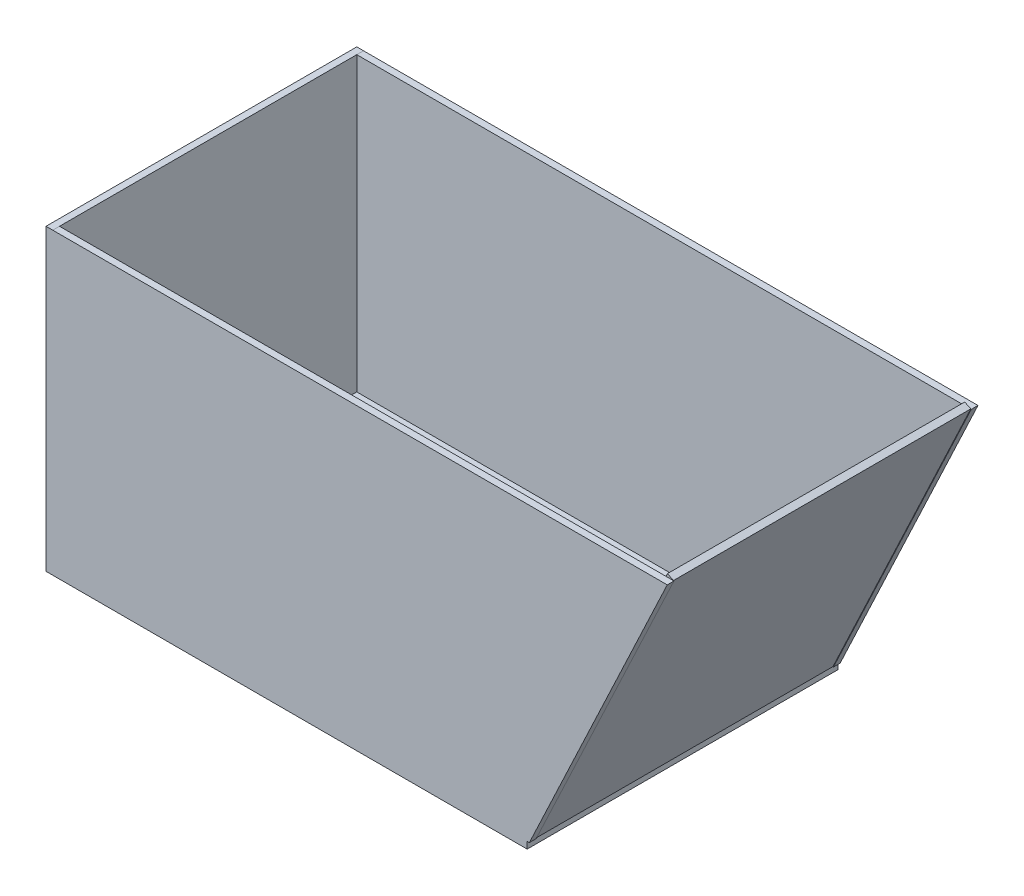
ISO-10303-21;
HEADER;
FILE_DESCRIPTION(('STEP AP214'),'2;1');
FILE_NAME('part.step','',(''),(''),'','','');
FILE_SCHEMA(('AUTOMOTIVE_DESIGN { 1 0 10303 214 1 1 1 1 }'));
ENDSEC;
DATA;
#1=APPLICATION_CONTEXT('core data for automotive mechanical design processes');
#2=APPLICATION_PROTOCOL_DEFINITION('international standard','automotive_design',2000,#1);
#3=PRODUCT_CONTEXT('',#1,'mechanical');
#4=PRODUCT('Part','Part','',(#3));
#5=PRODUCT_RELATED_PRODUCT_CATEGORY('part','',(#4));
#6=PRODUCT_DEFINITION_FORMATION('','',#4);
#7=PRODUCT_DEFINITION_CONTEXT('part definition',#1,'design');
#8=PRODUCT_DEFINITION('design','',#6,#7);
#9=PRODUCT_DEFINITION_SHAPE('','',#8);
#10=(LENGTH_UNIT() NAMED_UNIT(*) SI_UNIT(.MILLI.,.METRE.));
#11=(NAMED_UNIT(*) PLANE_ANGLE_UNIT() SI_UNIT($,.RADIAN.));
#12=(NAMED_UNIT(*) SI_UNIT($,.STERADIAN.) SOLID_ANGLE_UNIT());
#13=UNCERTAINTY_MEASURE_WITH_UNIT(LENGTH_MEASURE(1.E-05),#10,'distance_accuracy_value','');
#14=(GEOMETRIC_REPRESENTATION_CONTEXT(3) GLOBAL_UNCERTAINTY_ASSIGNED_CONTEXT((#13)) GLOBAL_UNIT_ASSIGNED_CONTEXT((#10,
#11,#12)) REPRESENTATION_CONTEXT('',''));
#15=CARTESIAN_POINT('',(0.,0.,0.));
#16=DIRECTION('',(0.,0.,1.));
#17=DIRECTION('',(1.,0.,0.));
#18=AXIS2_PLACEMENT_3D('',#15,#16,#17);
#19=CARTESIAN_POINT('',(352.233939342679,284.329831115546,139.934782687036));
#20=DIRECTION('',(0.,0.,1.));
#21=DIRECTION('',(1.,0.,0.));
#22=AXIS2_PLACEMENT_3D('',#19,#20,#21);
#23=PLANE('',#22);
#24=DIRECTION('',(-0.426808919266063,-0.904341830523689,0.));
#25=VECTOR('',#24,1.);
#26=CARTESIAN_POINT('',(357.976509966504,281.619594478207,139.934782687036));
#27=LINE('',#26,#25);
#28=CARTESIAN_POINT('',(357.976509966504,281.619594478207,139.934782687036));
#29=VERTEX_POINT('',#28);
#30=CARTESIAN_POINT('',(228.154221077472,6.54632145811838,139.934782687036));
#31=VERTEX_POINT('',#30);
#32=EDGE_CURVE('E112',#29,#31,#27,.T.);
#33=ORIENTED_EDGE('',*,*,#32,.F.);
#34=DIRECTION('',(0.904341830523688,-0.426808919266063,0.));
#35=VECTOR('',#34,1.);
#36=CARTESIAN_POINT('',(352.233939342679,284.329831115546,139.934782687036));
#37=LINE('',#36,#35);
#38=CARTESIAN_POINT('',(352.233939342679,284.329831115546,139.934782687036));
#39=VERTEX_POINT('',#38);
#40=EDGE_CURVE('E12',#39,#29,#37,.T.);
#41=ORIENTED_EDGE('',*,*,#40,.F.);
#42=DIRECTION('',(-0.426808919266063,-0.904341830523689,0.));
#43=VECTOR('',#42,1.);
#44=CARTESIAN_POINT('',(352.233939342679,284.329831115546,139.934782687036));
#45=LINE('',#44,#43);
#46=CARTESIAN_POINT('',(222.411650453647,9.25655809545788,139.934782687036));
#47=VERTEX_POINT('',#46);
#48=EDGE_CURVE('E106',#39,#47,#45,.T.);
#49=ORIENTED_EDGE('',*,*,#48,.T.);
#50=DIRECTION('',(0.904341830523688,-0.426808919266063,0.));
#51=VECTOR('',#50,1.);
#52=CARTESIAN_POINT('',(222.411650453647,9.25655809545788,139.934782687036));
#53=LINE('',#52,#51);
#54=EDGE_CURVE('E51',#47,#31,#53,.T.);
#55=ORIENTED_EDGE('',*,*,#54,.T.);
#56=EDGE_LOOP('',(#33,#41,#49,#55));
#57=FACE_BOUND('',#56,.T.);
#58=ADVANCED_FACE('F48',(#57),#23,.T.);
#59=CARTESIAN_POINT('',(352.233939342679,284.329831115546,139.934782687036));
#60=DIRECTION('',(0.426808919266063,0.904341830523688,0.));
#61=DIRECTION('',(-0.904341830523689,0.426808919266063,0.));
#62=AXIS2_PLACEMENT_3D('',#59,#60,#61);
#63=PLANE('',#62);
#64=DIRECTION('',(0.,0.,1.));
#65=VECTOR('',#64,1.);
#66=CARTESIAN_POINT('',(357.976509966504,281.619594478207,139.934782687036));
#67=LINE('',#66,#65);
#68=CARTESIAN_POINT('',(357.976509966504,281.619594478207,-139.934782687036));
#69=VERTEX_POINT('',#68);
#70=EDGE_CURVE('E108',#69,#29,#67,.T.);
#71=ORIENTED_EDGE('',*,*,#70,.F.);
#72=DIRECTION('',(0.904341830523688,-0.426808919266063,0.));
#73=VECTOR('',#72,1.);
#74=CARTESIAN_POINT('',(352.233939342679,284.329831115546,-139.934782687036));
#75=LINE('',#74,#73);
#76=CARTESIAN_POINT('',(352.233939342679,284.329831115546,-139.934782687036));
#77=VERTEX_POINT('',#76);
#78=EDGE_CURVE('E57',#77,#69,#75,.T.);
#79=ORIENTED_EDGE('',*,*,#78,.F.);
#80=DIRECTION('',(0.,0.,1.));
#81=VECTOR('',#80,1.);
#82=CARTESIAN_POINT('',(352.233939342679,284.329831115546,139.934782687036));
#83=LINE('',#82,#81);
#84=EDGE_CURVE('E103',#77,#39,#83,.T.);
#85=ORIENTED_EDGE('',*,*,#84,.T.);
#86=ORIENTED_EDGE('',*,*,#40,.T.);
#87=EDGE_LOOP('',(#71,#79,#85,#86));
#88=FACE_BOUND('',#87,.T.);
#89=ADVANCED_FACE('F122',(#88),#63,.T.);
#90=CARTESIAN_POINT('',(352.233939342679,284.329831115546,-139.934782687036));
#91=DIRECTION('',(0.,0.,-1.));
#92=DIRECTION('',(-1.,0.,0.));
#93=AXIS2_PLACEMENT_3D('',#90,#91,#92);
#94=PLANE('',#93);
#95=DIRECTION('',(0.426808919266063,0.904341830523689,0.));
#96=VECTOR('',#95,1.);
#97=CARTESIAN_POINT('',(357.976509966504,281.619594478207,-139.934782687036));
#98=LINE('',#97,#96);
#99=CARTESIAN_POINT('',(228.154221077472,6.54632145811838,-139.934782687036));
#100=VERTEX_POINT('',#99);
#101=EDGE_CURVE('E98',#100,#69,#98,.T.);
#102=ORIENTED_EDGE('',*,*,#101,.F.);
#103=DIRECTION('',(0.904341830523688,-0.426808919266063,0.));
#104=VECTOR('',#103,1.);
#105=CARTESIAN_POINT('',(222.411650453647,9.25655809545788,-139.934782687036));
#106=LINE('',#105,#104);
#107=CARTESIAN_POINT('',(222.411650453647,9.25655809545788,-139.934782687036));
#108=VERTEX_POINT('',#107);
#109=EDGE_CURVE('E93',#108,#100,#106,.T.);
#110=ORIENTED_EDGE('',*,*,#109,.F.);
#111=DIRECTION('',(0.426808919266063,0.904341830523689,0.));
#112=VECTOR('',#111,1.);
#113=CARTESIAN_POINT('',(352.233939342679,284.329831115546,-139.934782687036));
#114=LINE('',#113,#112);
#115=EDGE_CURVE('E96',#108,#77,#114,.T.);
#116=ORIENTED_EDGE('',*,*,#115,.T.);
#117=ORIENTED_EDGE('',*,*,#78,.T.);
#118=EDGE_LOOP('',(#102,#110,#116,#117));
#119=FACE_BOUND('',#118,.T.);
#120=ADVANCED_FACE('F95',(#119),#94,.T.);
#121=CARTESIAN_POINT('',(222.411650453647,9.25655809545788,139.934782687036));
#122=DIRECTION('',(-0.426808919266063,-0.904341830523688,0.));
#123=DIRECTION('',(0.904341830523689,-0.426808919266063,0.));
#124=AXIS2_PLACEMENT_3D('',#121,#122,#123);
#125=PLANE('',#124);
#126=DIRECTION('',(0.,0.,-1.));
#127=VECTOR('',#126,1.);
#128=CARTESIAN_POINT('',(228.154221077472,6.54632145811838,139.934782687036));
#129=LINE('',#128,#127);
#130=EDGE_CURVE('E115',#31,#100,#129,.T.);
#131=ORIENTED_EDGE('',*,*,#130,.F.);
#132=ORIENTED_EDGE('',*,*,#54,.F.);
#133=DIRECTION('',(0.,0.,-1.));
#134=VECTOR('',#133,1.);
#135=CARTESIAN_POINT('',(222.411650453647,9.25655809545788,139.934782687036));
#136=LINE('',#135,#134);
#137=EDGE_CURVE('E102',#47,#108,#136,.T.);
#138=ORIENTED_EDGE('',*,*,#137,.T.);
#139=ORIENTED_EDGE('',*,*,#109,.T.);
#140=EDGE_LOOP('',(#131,#132,#138,#139));
#141=FACE_BOUND('',#140,.T.);
#142=ADVANCED_FACE('F105',(#141),#125,.T.);
#143=CARTESIAN_POINT('',(178.322985280826,-84.1604778847105,0.));
#144=DIRECTION('',(0.904341830523689,-0.426808919266063,0.));
#145=DIRECTION('',(0.426808919266063,0.904341830523689,0.));
#146=AXIS2_PLACEMENT_3D('',#143,#144,#145);
#147=PLANE('',#146);
#148=ORIENTED_EDGE('',*,*,#48,.F.);
#149=ORIENTED_EDGE('',*,*,#84,.F.);
#150=ORIENTED_EDGE('',*,*,#115,.F.);
#151=ORIENTED_EDGE('',*,*,#137,.F.);
#152=EDGE_LOOP('',(#148,#149,#150,#151));
#153=FACE_BOUND('',#152,.T.);
#154=ADVANCED_FACE('F101',(#153),#147,.F.);
#155=CARTESIAN_POINT('',(184.065555904652,-86.87071452205,0.));
#156=DIRECTION('',(0.904341830523689,-0.426808919266063,0.));
#157=DIRECTION('',(0.426808919266063,0.904341830523689,0.));
#158=AXIS2_PLACEMENT_3D('',#155,#156,#157);
#159=PLANE('',#158);
#160=ORIENTED_EDGE('',*,*,#32,.T.);
#161=ORIENTED_EDGE('',*,*,#130,.T.);
#162=ORIENTED_EDGE('',*,*,#101,.T.);
#163=ORIENTED_EDGE('',*,*,#70,.T.);
#164=EDGE_LOOP('',(#160,#161,#162,#163));
#165=FACE_BOUND('',#164,.T.);
#166=ADVANCED_FACE('F121',(#165),#159,.T.);
#167=CLOSED_SHELL('',(#58,#89,#120,#142,#154,#166));
#168=MANIFOLD_SOLID_BREP('B2',#167);
#169=CARTESIAN_POINT('',(0.,6.35,0.));
#170=DIRECTION('',(0.,-1.,0.));
#171=DIRECTION('',(0.,0.,-1.));
#172=AXIS2_PLACEMENT_3D('',#169,#170,#171);
#173=PLANE('',#172);
#174=DIRECTION('',(1.,0.,0.));
#175=VECTOR('',#174,1.);
#176=CARTESIAN_POINT('',(228.570195764953,6.35000000000006,-139.934782687036));
#177=LINE('',#176,#175);
#178=CARTESIAN_POINT('',(-220.15,6.35,-139.934782687036));
#179=VERTEX_POINT('',#178);
#180=CARTESIAN_POINT('',(226.5,6.35000000000006,-139.934782687036));
#181=VERTEX_POINT('',#180);
#182=EDGE_CURVE('E303',#179,#181,#177,.T.);
#183=ORIENTED_EDGE('',*,*,#182,.F.);
#184=DIRECTION('',(0.,0.,-1.));
#185=VECTOR('',#184,1.);
#186=CARTESIAN_POINT('',(-220.15,6.35,-146.284782687036));
#187=LINE('',#186,#185);
#188=CARTESIAN_POINT('',(-220.15,6.35,139.934782687036));
#189=VERTEX_POINT('',#188);
#190=EDGE_CURVE('E335',#189,#179,#187,.T.);
#191=ORIENTED_EDGE('',*,*,#190,.F.);
#192=DIRECTION('',(1.,0.,0.));
#193=VECTOR('',#192,1.);
#194=CARTESIAN_POINT('',(228.570195764953,6.35000000000006,139.934782687036));
#195=LINE('',#194,#193);
#196=CARTESIAN_POINT('',(226.5,6.35000000000006,139.934782687036));
#197=VERTEX_POINT('',#196);
#198=EDGE_CURVE('E320',#189,#197,#195,.T.);
#199=ORIENTED_EDGE('',*,*,#198,.T.);
#200=DIRECTION('',(0.,0.,-1.));
#201=VECTOR('',#200,1.);
#202=CARTESIAN_POINT('',(226.5,6.35,146.284782687036));
#203=LINE('',#202,#201);
#204=EDGE_CURVE('E357',#197,#181,#203,.T.);
#205=ORIENTED_EDGE('',*,*,#204,.T.);
#206=EDGE_LOOP('',(#183,#191,#199,#205));
#207=FACE_BOUND('',#206,.T.);
#208=ADVANCED_FACE('F183',(#207),#173,.F.);
#209=CARTESIAN_POINT('',(-220.15,281.35,-146.284782687036));
#210=DIRECTION('',(-1.,0.,0.));
#211=DIRECTION('',(0.,0.,1.));
#212=AXIS2_PLACEMENT_3D('',#209,#210,#211);
#213=PLANE('',#212);
#214=DIRECTION('',(0.,-1.,0.));
#215=VECTOR('',#214,1.);
#216=CARTESIAN_POINT('',(-220.15,6.35,-139.934782687036));
#217=LINE('',#216,#215);
#218=CARTESIAN_POINT('',(-220.15,281.35,-139.934782687036));
#219=VERTEX_POINT('',#218);
#220=EDGE_CURVE('E293',#219,#179,#217,.T.);
#221=ORIENTED_EDGE('',*,*,#220,.F.);
#222=DIRECTION('',(0.,0.,-1.));
#223=VECTOR('',#222,1.);
#224=CARTESIAN_POINT('',(-220.15,281.35,-146.284782687036));
#225=LINE('',#224,#223);
#226=CARTESIAN_POINT('',(-220.15,281.35,139.934782687036));
#227=VERTEX_POINT('',#226);
#228=EDGE_CURVE('E344',#227,#219,#225,.T.);
#229=ORIENTED_EDGE('',*,*,#228,.F.);
#230=DIRECTION('',(0.,-1.,0.));
#231=VECTOR('',#230,1.);
#232=CARTESIAN_POINT('',(-220.15,6.35,139.934782687036));
#233=LINE('',#232,#231);
#234=EDGE_CURVE('E315',#227,#189,#233,.T.);
#235=ORIENTED_EDGE('',*,*,#234,.T.);
#236=ORIENTED_EDGE('',*,*,#190,.T.);
#237=EDGE_LOOP('',(#221,#229,#235,#236));
#238=FACE_BOUND('',#237,.T.);
#239=ADVANCED_FACE('F409',(#238),#213,.F.);
#240=CARTESIAN_POINT('',(226.5,6.35,146.284782687036));
#241=DIRECTION('',(-1.,0.,0.));
#242=DIRECTION('',(0.,0.,1.));
#243=AXIS2_PLACEMENT_3D('',#240,#241,#242);
#244=PLANE('',#243);
#245=DIRECTION('',(0.,0.,-1.));
#246=VECTOR('',#245,1.);
#247=CARTESIAN_POINT('',(226.5,0.,146.284782687036));
#248=LINE('',#247,#246);
#249=CARTESIAN_POINT('',(226.5,0.,146.284782687036));
#250=VERTEX_POINT('',#249);
#251=CARTESIAN_POINT('',(226.5,0.,-146.284782687036));
#252=VERTEX_POINT('',#251);
#253=EDGE_CURVE('E351',#250,#252,#248,.T.);
#254=ORIENTED_EDGE('',*,*,#253,.T.);
#255=DIRECTION('',(0.,-1.,0.));
#256=VECTOR('',#255,1.);
#257=CARTESIAN_POINT('',(226.5,6.35,-146.284782687036));
#258=LINE('',#257,#256);
#259=CARTESIAN_POINT('',(226.5,6.35000000000006,-146.284782687036));
#260=VERTEX_POINT('',#259);
#261=EDGE_CURVE('E46',#260,#252,#258,.T.);
#262=ORIENTED_EDGE('',*,*,#261,.F.);
#263=DIRECTION('',(0.,0.,-1.));
#264=VECTOR('',#263,1.);
#265=CARTESIAN_POINT('',(226.5,6.35000000000006,146.284782687036));
#266=LINE('',#265,#264);
#267=EDGE_CURVE('E310',#181,#260,#266,.T.);
#268=ORIENTED_EDGE('',*,*,#267,.F.);
#269=ORIENTED_EDGE('',*,*,#204,.F.);
#270=CARTESIAN_POINT('',(226.5,6.35000000000006,146.284782687036));
#271=VERTEX_POINT('',#270);
#272=EDGE_CURVE('E354',#271,#197,#203,.T.);
#273=ORIENTED_EDGE('',*,*,#272,.F.);
#274=DIRECTION('',(0.,-1.,0.));
#275=VECTOR('',#274,1.);
#276=CARTESIAN_POINT('',(226.5,6.35,146.284782687036));
#277=LINE('',#276,#275);
#278=EDGE_CURVE('E356',#271,#250,#277,.T.);
#279=ORIENTED_EDGE('',*,*,#278,.T.);
#280=EDGE_LOOP('',(#254,#262,#268,#269,#273,#279));
#281=FACE_BOUND('',#280,.T.);
#282=ADVANCED_FACE('F185',(#281),#244,.F.);
#283=CARTESIAN_POINT('',(-226.5,6.35,-146.284782687036));
#284=DIRECTION('',(0.,0.,1.));
#285=DIRECTION('',(1.,0.,0.));
#286=AXIS2_PLACEMENT_3D('',#283,#284,#285);
#287=PLANE('',#286);
#288=DIRECTION('',(-1.,0.,0.));
#289=VECTOR('',#288,1.);
#290=CARTESIAN_POINT('',(-226.5,0.,-146.284782687036));
#291=LINE('',#290,#289);
#292=CARTESIAN_POINT('',(-226.5,0.,-146.284782687036));
#293=VERTEX_POINT('',#292);
#294=EDGE_CURVE('E360',#252,#293,#291,.T.);
#295=ORIENTED_EDGE('',*,*,#294,.T.);
#296=DIRECTION('',(0.,-1.,0.));
#297=VECTOR('',#296,1.);
#298=CARTESIAN_POINT('',(-226.5,6.35,-146.284782687036));
#299=LINE('',#298,#297);
#300=CARTESIAN_POINT('',(-226.5,281.35,-146.284782687036));
#301=VERTEX_POINT('',#300);
#302=EDGE_CURVE('E191',#301,#293,#299,.T.);
#303=ORIENTED_EDGE('',*,*,#302,.F.);
#304=DIRECTION('',(-1.,0.,0.));
#305=VECTOR('',#304,1.);
#306=CARTESIAN_POINT('',(-226.5,281.35,-146.284782687036));
#307=LINE('',#306,#305);
#308=CARTESIAN_POINT('',(-220.15,281.35,-146.284782687036));
#309=VERTEX_POINT('',#308);
#310=EDGE_CURVE('E348',#309,#301,#307,.T.);
#311=ORIENTED_EDGE('',*,*,#310,.F.);
#312=DIRECTION('',(-0.999999991979754,-0.000126651060974976,0.));
#313=VECTOR('',#312,1.);
#314=CARTESIAN_POINT('',(-220.15,281.35,-146.284782687036));
#315=LINE('',#314,#313);
#316=CARTESIAN_POINT('',(358.392484653985,281.423273020088,-146.284782687036));
#317=VERTEX_POINT('',#316);
#318=EDGE_CURVE('E306',#317,#309,#315,.T.);
#319=ORIENTED_EDGE('',*,*,#318,.F.);
#320=DIRECTION('',(0.426808919266063,0.904341830523689,0.));
#321=VECTOR('',#320,1.);
#322=CARTESIAN_POINT('',(358.392484653985,281.423273020088,-146.284782687036));
#323=LINE('',#322,#321);
#324=CARTESIAN_POINT('',(228.570195764953,6.35000000000006,-146.284782687036));
#325=VERTEX_POINT('',#324);
#326=EDGE_CURVE('E289',#325,#317,#323,.T.);
#327=ORIENTED_EDGE('',*,*,#326,.F.);
#328=DIRECTION('',(1.,0.,0.));
#329=VECTOR('',#328,1.);
#330=CARTESIAN_POINT('',(228.570195764953,6.35000000000006,-146.284782687036));
#331=LINE('',#330,#329);
#332=EDGE_CURVE('E299',#260,#325,#331,.T.);
#333=ORIENTED_EDGE('',*,*,#332,.F.);
#334=ORIENTED_EDGE('',*,*,#261,.T.);
#335=EDGE_LOOP('',(#295,#303,#311,#319,#327,#333,#334));
#336=FACE_BOUND('',#335,.T.);
#337=ADVANCED_FACE('F397',(#336),#287,.F.);
#338=CARTESIAN_POINT('',(-226.5,6.35,146.284782687036));
#339=DIRECTION('',(1.,0.,0.));
#340=DIRECTION('',(0.,0.,-1.));
#341=AXIS2_PLACEMENT_3D('',#338,#339,#340);
#342=PLANE('',#341);
#343=DIRECTION('',(0.,0.,1.));
#344=VECTOR('',#343,1.);
#345=CARTESIAN_POINT('',(-226.5,0.,146.284782687036));
#346=LINE('',#345,#344);
#347=CARTESIAN_POINT('',(-226.5,0.,146.284782687036));
#348=VERTEX_POINT('',#347);
#349=EDGE_CURVE('E362',#293,#348,#346,.T.);
#350=ORIENTED_EDGE('',*,*,#349,.T.);
#351=DIRECTION('',(0.,-1.,0.));
#352=VECTOR('',#351,1.);
#353=CARTESIAN_POINT('',(-226.5,6.35,146.284782687036));
#354=LINE('',#353,#352);
#355=CARTESIAN_POINT('',(-226.5,281.35,146.284782687036));
#356=VERTEX_POINT('',#355);
#357=EDGE_CURVE('E366',#356,#348,#354,.T.);
#358=ORIENTED_EDGE('',*,*,#357,.F.);
#359=DIRECTION('',(0.,0.,1.));
#360=VECTOR('',#359,1.);
#361=CARTESIAN_POINT('',(-226.5,281.35,-146.284782687036));
#362=LINE('',#361,#360);
#363=EDGE_CURVE('E338',#301,#356,#362,.T.);
#364=ORIENTED_EDGE('',*,*,#363,.F.);
#365=ORIENTED_EDGE('',*,*,#302,.T.);
#366=EDGE_LOOP('',(#350,#358,#364,#365));
#367=FACE_BOUND('',#366,.T.);
#368=ADVANCED_FACE('F371',(#367),#342,.F.);
#369=CARTESIAN_POINT('',(-226.5,6.35,146.284782687036));
#370=DIRECTION('',(0.,0.,-1.));
#371=DIRECTION('',(-1.,0.,0.));
#372=AXIS2_PLACEMENT_3D('',#369,#370,#371);
#373=PLANE('',#372);
#374=ORIENTED_EDGE('',*,*,#278,.F.);
#375=DIRECTION('',(1.,0.,0.));
#376=VECTOR('',#375,1.);
#377=CARTESIAN_POINT('',(228.570195764953,6.35000000000006,146.284782687036));
#378=LINE('',#377,#376);
#379=CARTESIAN_POINT('',(228.570195764953,6.35000000000006,146.284782687036));
#380=VERTEX_POINT('',#379);
#381=EDGE_CURVE('E329',#271,#380,#378,.T.);
#382=ORIENTED_EDGE('',*,*,#381,.T.);
#383=DIRECTION('',(0.426808919266063,0.904341830523689,0.));
#384=VECTOR('',#383,1.);
#385=CARTESIAN_POINT('',(358.392484653985,281.423273020088,146.284782687036));
#386=LINE('',#385,#384);
#387=CARTESIAN_POINT('',(358.392484653985,281.423273020088,146.284782687036));
#388=VERTEX_POINT('',#387);
#389=EDGE_CURVE('E316',#380,#388,#386,.T.);
#390=ORIENTED_EDGE('',*,*,#389,.T.);
#391=DIRECTION('',(-0.999999991979754,-0.000126651060974976,0.));
#392=VECTOR('',#391,1.);
#393=CARTESIAN_POINT('',(-220.15,281.35,146.284782687036));
#394=LINE('',#393,#392);
#395=CARTESIAN_POINT('',(-220.15,281.35,146.284782687036));
#396=VERTEX_POINT('',#395);
#397=EDGE_CURVE('E313',#388,#396,#394,.T.);
#398=ORIENTED_EDGE('',*,*,#397,.T.);
#399=DIRECTION('',(1.,0.,0.));
#400=VECTOR('',#399,1.);
#401=CARTESIAN_POINT('',(-226.5,281.35,146.284782687036));
#402=LINE('',#401,#400);
#403=EDGE_CURVE('E341',#356,#396,#402,.T.);
#404=ORIENTED_EDGE('',*,*,#403,.F.);
#405=ORIENTED_EDGE('',*,*,#357,.T.);
#406=DIRECTION('',(1.,0.,0.));
#407=VECTOR('',#406,1.);
#408=CARTESIAN_POINT('',(-226.5,0.,146.284782687036));
#409=LINE('',#408,#407);
#410=EDGE_CURVE('E206',#348,#250,#409,.T.);
#411=ORIENTED_EDGE('',*,*,#410,.T.);
#412=EDGE_LOOP('',(#374,#382,#390,#398,#404,#405,#411));
#413=FACE_BOUND('',#412,.T.);
#414=ADVANCED_FACE('F382',(#413),#373,.F.);
#415=CARTESIAN_POINT('',(0.,0.,0.));
#416=DIRECTION('',(0.,-1.,0.));
#417=DIRECTION('',(0.,0.,-1.));
#418=AXIS2_PLACEMENT_3D('',#415,#416,#417);
#419=PLANE('',#418);
#420=ORIENTED_EDGE('',*,*,#253,.F.);
#421=ORIENTED_EDGE('',*,*,#410,.F.);
#422=ORIENTED_EDGE('',*,*,#349,.F.);
#423=ORIENTED_EDGE('',*,*,#294,.F.);
#424=EDGE_LOOP('',(#420,#421,#422,#423));
#425=FACE_BOUND('',#424,.T.);
#426=ADVANCED_FACE('F376',(#425),#419,.T.);
#427=CARTESIAN_POINT('',(0.,281.35,0.));
#428=DIRECTION('',(0.,1.,0.));
#429=DIRECTION('',(0.,0.,1.));
#430=AXIS2_PLACEMENT_3D('',#427,#428,#429);
#431=PLANE('',#430);
#432=ORIENTED_EDGE('',*,*,#363,.T.);
#433=ORIENTED_EDGE('',*,*,#403,.T.);
#434=EDGE_CURVE('E345',#396,#227,#225,.T.);
#435=ORIENTED_EDGE('',*,*,#434,.T.);
#436=ORIENTED_EDGE('',*,*,#228,.T.);
#437=DIRECTION('',(0.,0.,-1.));
#438=VECTOR('',#437,1.);
#439=CARTESIAN_POINT('',(-220.15,281.35,-139.934782687036));
#440=LINE('',#439,#438);
#441=EDGE_CURVE('E297',#219,#309,#440,.T.);
#442=ORIENTED_EDGE('',*,*,#441,.T.);
#443=ORIENTED_EDGE('',*,*,#310,.T.);
#444=EDGE_LOOP('',(#432,#433,#435,#436,#442,#443));
#445=FACE_BOUND('',#444,.T.);
#446=ADVANCED_FACE('F395',(#445),#431,.T.);
#447=CARTESIAN_POINT('',(228.570195764953,6.35000000000006,139.934782687036));
#448=DIRECTION('',(0.,-1.,0.));
#449=DIRECTION('',(1.,0.,0.));
#450=AXIS2_PLACEMENT_3D('',#447,#448,#449);
#451=PLANE('',#450);
#452=ORIENTED_EDGE('',*,*,#272,.T.);
#453=CARTESIAN_POINT('',(228.570195764953,6.35000000000006,139.934782687036));
#454=VERTEX_POINT('',#453);
#455=EDGE_CURVE('E319',#197,#454,#195,.T.);
#456=ORIENTED_EDGE('',*,*,#455,.T.);
#457=DIRECTION('',(0.,0.,1.));
#458=VECTOR('',#457,1.);
#459=CARTESIAN_POINT('',(228.570195764953,6.35000000000006,139.934782687036));
#460=LINE('',#459,#458);
#461=EDGE_CURVE('E326',#454,#380,#460,.T.);
#462=ORIENTED_EDGE('',*,*,#461,.T.);
#463=ORIENTED_EDGE('',*,*,#381,.F.);
#464=EDGE_LOOP('',(#452,#456,#462,#463));
#465=FACE_BOUND('',#464,.T.);
#466=ADVANCED_FACE('F386',(#465),#451,.T.);
#467=CARTESIAN_POINT('',(-220.15,281.35,139.934782687036));
#468=DIRECTION('',(-0.000126651060974976,0.999999991979754,0.));
#469=DIRECTION('',(-0.999999991979754,-0.000126651060974976,0.));
#470=AXIS2_PLACEMENT_3D('',#467,#468,#469);
#471=PLANE('',#470);
#472=ORIENTED_EDGE('',*,*,#397,.F.);
#473=DIRECTION('',(0.,0.,1.));
#474=VECTOR('',#473,1.);
#475=CARTESIAN_POINT('',(358.392484653985,281.423273020088,139.934782687036));
#476=LINE('',#475,#474);
#477=CARTESIAN_POINT('',(358.392484653985,281.423273020088,139.934782687036));
#478=VERTEX_POINT('',#477);
#479=EDGE_CURVE('E333',#478,#388,#476,.T.);
#480=ORIENTED_EDGE('',*,*,#479,.F.);
#481=DIRECTION('',(-0.999999991979754,-0.000126651060974976,0.));
#482=VECTOR('',#481,1.);
#483=CARTESIAN_POINT('',(-220.15,281.35,139.934782687036));
#484=LINE('',#483,#482);
#485=EDGE_CURVE('E198',#478,#227,#484,.T.);
#486=ORIENTED_EDGE('',*,*,#485,.T.);
#487=ORIENTED_EDGE('',*,*,#434,.F.);
#488=EDGE_LOOP('',(#472,#480,#486,#487));
#489=FACE_BOUND('',#488,.T.);
#490=ADVANCED_FACE('F392',(#489),#471,.T.);
#491=CARTESIAN_POINT('',(358.392484653985,281.423273020088,139.934782687036));
#492=DIRECTION('',(0.904341830523688,-0.426808919266062,0.));
#493=DIRECTION('',(0.426808919266063,0.904341830523689,0.));
#494=AXIS2_PLACEMENT_3D('',#491,#492,#493);
#495=PLANE('',#494);
#496=ORIENTED_EDGE('',*,*,#389,.F.);
#497=ORIENTED_EDGE('',*,*,#461,.F.);
#498=DIRECTION('',(0.426808919266063,0.904341830523689,0.));
#499=VECTOR('',#498,1.);
#500=CARTESIAN_POINT('',(358.392484653985,281.423273020088,139.934782687036));
#501=LINE('',#500,#499);
#502=EDGE_CURVE('E323',#454,#478,#501,.T.);
#503=ORIENTED_EDGE('',*,*,#502,.T.);
#504=ORIENTED_EDGE('',*,*,#479,.T.);
#505=EDGE_LOOP('',(#496,#497,#503,#504));
#506=FACE_BOUND('',#505,.T.);
#507=ADVANCED_FACE('F390',(#506),#495,.T.);
#508=CARTESIAN_POINT('',(0.,0.,139.934782687036));
#509=DIRECTION('',(0.,0.,1.));
#510=DIRECTION('',(1.,0.,0.));
#511=AXIS2_PLACEMENT_3D('',#508,#509,#510);
#512=PLANE('',#511);
#513=ORIENTED_EDGE('',*,*,#485,.F.);
#514=ORIENTED_EDGE('',*,*,#502,.F.);
#515=ORIENTED_EDGE('',*,*,#455,.F.);
#516=ORIENTED_EDGE('',*,*,#198,.F.);
#517=ORIENTED_EDGE('',*,*,#234,.F.);
#518=EDGE_LOOP('',(#513,#514,#515,#516,#517));
#519=FACE_BOUND('',#518,.T.);
#520=ADVANCED_FACE('F406',(#519),#512,.F.);
#521=CARTESIAN_POINT('',(228.570195764953,6.35000000000006,-139.934782687036));
#522=DIRECTION('',(0.,1.,0.));
#523=DIRECTION('',(-1.,0.,0.));
#524=AXIS2_PLACEMENT_3D('',#521,#522,#523);
#525=PLANE('',#524);
#526=CARTESIAN_POINT('',(228.570195764953,6.35000000000006,-139.934782687036));
#527=VERTEX_POINT('',#526);
#528=EDGE_CURVE('E280',#181,#527,#177,.T.);
#529=ORIENTED_EDGE('',*,*,#528,.F.);
#530=ORIENTED_EDGE('',*,*,#267,.T.);
#531=ORIENTED_EDGE('',*,*,#332,.T.);
#532=DIRECTION('',(0.,0.,-1.));
#533=VECTOR('',#532,1.);
#534=CARTESIAN_POINT('',(228.570195764953,6.35000000000006,-139.934782687036));
#535=LINE('',#534,#533);
#536=EDGE_CURVE('E292',#527,#325,#535,.T.);
#537=ORIENTED_EDGE('',*,*,#536,.F.);
#538=EDGE_LOOP('',(#529,#530,#531,#537));
#539=FACE_BOUND('',#538,.T.);
#540=ADVANCED_FACE('F400',(#539),#525,.F.);
#541=CARTESIAN_POINT('',(-220.15,281.35,-139.934782687036));
#542=DIRECTION('',(0.000126651060974976,-0.999999991979754,0.));
#543=DIRECTION('',(0.999999991979754,0.000126651060974976,0.));
#544=AXIS2_PLACEMENT_3D('',#541,#542,#543);
#545=PLANE('',#544);
#546=ORIENTED_EDGE('',*,*,#318,.T.);
#547=ORIENTED_EDGE('',*,*,#441,.F.);
#548=DIRECTION('',(-0.999999991979754,-0.000126651060974976,0.));
#549=VECTOR('',#548,1.);
#550=CARTESIAN_POINT('',(-220.15,281.35,-139.934782687036));
#551=LINE('',#550,#549);
#552=CARTESIAN_POINT('',(358.392484653985,281.423273020088,-139.934782687036));
#553=VERTEX_POINT('',#552);
#554=EDGE_CURVE('E277',#553,#219,#551,.T.);
#555=ORIENTED_EDGE('',*,*,#554,.F.);
#556=DIRECTION('',(0.,0.,-1.));
#557=VECTOR('',#556,1.);
#558=CARTESIAN_POINT('',(358.392484653985,281.423273020088,-139.934782687036));
#559=LINE('',#558,#557);
#560=EDGE_CURVE('E286',#553,#317,#559,.T.);
#561=ORIENTED_EDGE('',*,*,#560,.T.);
#562=EDGE_LOOP('',(#546,#547,#555,#561));
#563=FACE_BOUND('',#562,.T.);
#564=ADVANCED_FACE('F295',(#563),#545,.F.);
#565=CARTESIAN_POINT('',(358.392484653985,281.423273020088,-139.934782687036));
#566=DIRECTION('',(-0.904341830523688,0.426808919266062,0.));
#567=DIRECTION('',(-0.426808919266063,-0.904341830523689,0.));
#568=AXIS2_PLACEMENT_3D('',#565,#566,#567);
#569=PLANE('',#568);
#570=ORIENTED_EDGE('',*,*,#326,.T.);
#571=ORIENTED_EDGE('',*,*,#560,.F.);
#572=DIRECTION('',(0.426808919266063,0.904341830523689,0.));
#573=VECTOR('',#572,1.);
#574=CARTESIAN_POINT('',(358.392484653985,281.423273020088,-139.934782687036));
#575=LINE('',#574,#573);
#576=EDGE_CURVE('E273',#527,#553,#575,.T.);
#577=ORIENTED_EDGE('',*,*,#576,.F.);
#578=ORIENTED_EDGE('',*,*,#536,.T.);
#579=EDGE_LOOP('',(#570,#571,#577,#578));
#580=FACE_BOUND('',#579,.T.);
#581=ADVANCED_FACE('F287',(#580),#569,.F.);
#582=CARTESIAN_POINT('',(0.,0.,-139.934782687036));
#583=DIRECTION('',(0.,0.,-1.));
#584=DIRECTION('',(1.,0.,0.));
#585=AXIS2_PLACEMENT_3D('',#582,#583,#584);
#586=PLANE('',#585);
#587=ORIENTED_EDGE('',*,*,#554,.T.);
#588=ORIENTED_EDGE('',*,*,#220,.T.);
#589=ORIENTED_EDGE('',*,*,#182,.T.);
#590=ORIENTED_EDGE('',*,*,#528,.T.);
#591=ORIENTED_EDGE('',*,*,#576,.T.);
#592=EDGE_LOOP('',(#587,#588,#589,#590,#591));
#593=FACE_BOUND('',#592,.T.);
#594=ADVANCED_FACE('F275',(#593),#586,.F.);
#595=CLOSED_SHELL('',(#208,#239,#282,#337,#368,#414,#426,#446,#466,#490,#507,#520,#540,#564,
#581,#594));
#596=MANIFOLD_SOLID_BREP('B6',#595);
#597=ADVANCED_BREP_SHAPE_REPRESENTATION('',(#18,#168,#596),#14);
#598=SHAPE_DEFINITION_REPRESENTATION(#9,#597);
ENDSEC;
END-ISO-10303-21;
